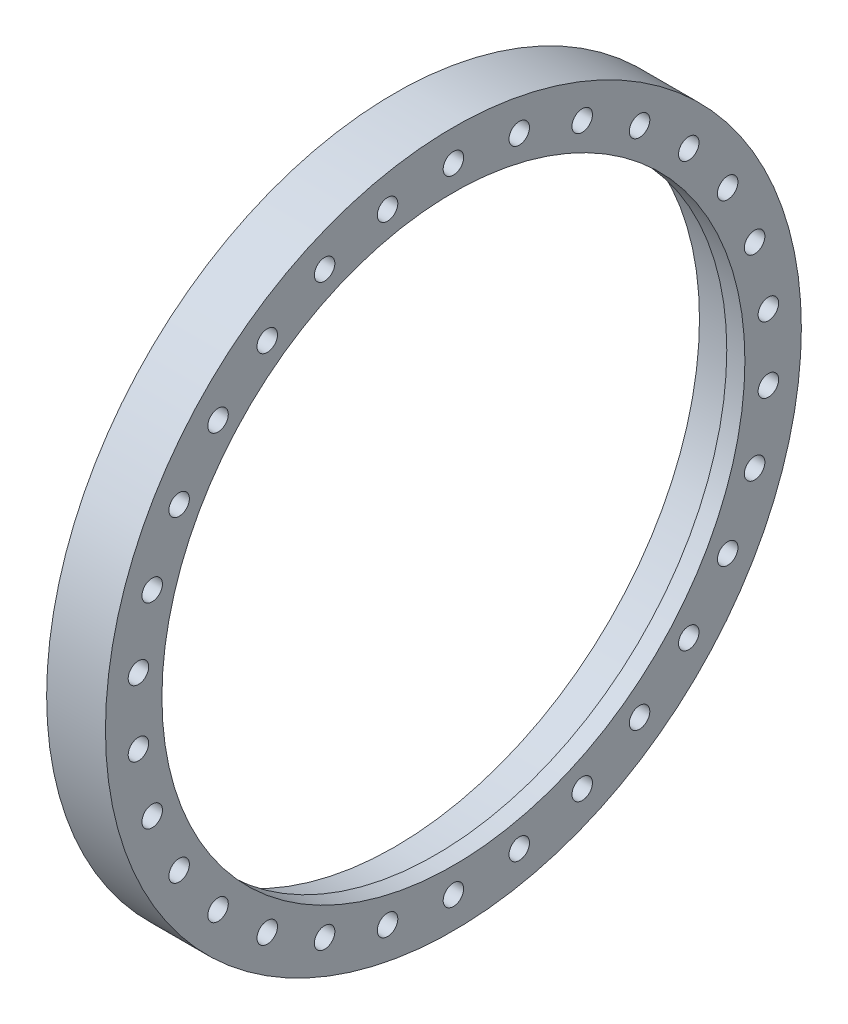
ISO-10303-21;
HEADER;
FILE_DESCRIPTION(('STEP AP214'),'2;1');
FILE_NAME('part.step','',(''),(''),'','','');
FILE_SCHEMA(('AUTOMOTIVE_DESIGN { 1 0 10303 214 1 1 1 1 }'));
ENDSEC;
DATA;
#1=APPLICATION_CONTEXT('core data for automotive mechanical design processes');
#2=APPLICATION_PROTOCOL_DEFINITION('international standard','automotive_design',2000,#1);
#3=PRODUCT_CONTEXT('',#1,'mechanical');
#4=PRODUCT('Part','Part','',(#3));
#5=PRODUCT_RELATED_PRODUCT_CATEGORY('part','',(#4));
#6=PRODUCT_DEFINITION_FORMATION('','',#4);
#7=PRODUCT_DEFINITION_CONTEXT('part definition',#1,'design');
#8=PRODUCT_DEFINITION('design','',#6,#7);
#9=PRODUCT_DEFINITION_SHAPE('','',#8);
#10=(LENGTH_UNIT() NAMED_UNIT(*) SI_UNIT(.MILLI.,.METRE.));
#11=(NAMED_UNIT(*) PLANE_ANGLE_UNIT() SI_UNIT($,.RADIAN.));
#12=(NAMED_UNIT(*) SI_UNIT($,.STERADIAN.) SOLID_ANGLE_UNIT());
#13=UNCERTAINTY_MEASURE_WITH_UNIT(LENGTH_MEASURE(1.E-05),#10,'distance_accuracy_value','');
#14=(GEOMETRIC_REPRESENTATION_CONTEXT(3) GLOBAL_UNCERTAINTY_ASSIGNED_CONTEXT((#13)) GLOBAL_UNIT_ASSIGNED_CONTEXT((#10,
#11,#12)) REPRESENTATION_CONTEXT('',''));
#15=CARTESIAN_POINT('',(0.,0.,0.));
#16=DIRECTION('',(0.,0.,1.));
#17=DIRECTION('',(1.,0.,0.));
#18=AXIS2_PLACEMENT_3D('',#15,#16,#17);
#19=CARTESIAN_POINT('',(19.6849999999996,144.2085,0.));
#20=DIRECTION('',(-1.,0.,0.));
#21=DIRECTION('',(0.,0.,1.));
#22=AXIS2_PLACEMENT_3D('',#19,#20,#21);
#23=PLANE('',#22);
#24=CARTESIAN_POINT('',(19.6849999999996,0.,0.));
#25=DIRECTION('',(1.,0.,0.));
#26=DIRECTION('',(0.,0.,-1.));
#27=AXIS2_PLACEMENT_3D('',#24,#25,#26);
#28=CIRCLE('',#27,140.97);
#29=CARTESIAN_POINT('',(19.6849999999996,0.,-140.97));
#30=VERTEX_POINT('',#29);
#31=EDGE_CURVE('E19',#30,#30,#28,.T.);
#32=ORIENTED_EDGE('',*,*,#31,.T.);
#33=EDGE_LOOP('',(#32));
#34=FACE_BOUND('',#33,.T.);
#35=CARTESIAN_POINT('',(19.6849999999996,0.,0.));
#36=DIRECTION('',(1.,0.,0.));
#37=DIRECTION('',(0.,0.,-1.));
#38=AXIS2_PLACEMENT_3D('',#35,#36,#37);
#39=CIRCLE('',#38,147.447);
#40=CARTESIAN_POINT('',(19.6849999999996,0.,-147.447));
#41=VERTEX_POINT('',#40);
#42=EDGE_CURVE('E215',#41,#41,#39,.F.);
#43=ORIENTED_EDGE('',*,*,#42,.T.);
#44=EDGE_LOOP('',(#43));
#45=FACE_BOUND('',#44,.T.);
#46=ADVANCED_FACE('F15',(#34,#45),#23,.T.);
#47=CARTESIAN_POINT('',(24.0664999999997,0.,0.));
#48=DIRECTION('',(1.,0.,0.));
#49=DIRECTION('',(0.,0.,-1.));
#50=AXIS2_PLACEMENT_3D('',#47,#48,#49);
#51=CYLINDRICAL_SURFACE('',#50,140.97);
#52=CARTESIAN_POINT('',(28.4479999999997,0.,0.));
#53=DIRECTION('',(1.,0.,0.));
#54=DIRECTION('',(0.,0.,-1.));
#55=AXIS2_PLACEMENT_3D('',#52,#53,#54);
#56=CIRCLE('',#55,140.97);
#57=CARTESIAN_POINT('',(28.4479999999997,0.,-140.97));
#58=VERTEX_POINT('',#57);
#59=EDGE_CURVE('E123',#58,#58,#56,.F.);
#60=ORIENTED_EDGE('',*,*,#59,.F.);
#61=EDGE_LOOP('',(#60));
#62=FACE_BOUND('',#61,.T.);
#63=ORIENTED_EDGE('',*,*,#31,.F.);
#64=EDGE_LOOP('',(#63));
#65=FACE_BOUND('',#64,.T.);
#66=ADVANCED_FACE('F223',(#62,#65),#51,.F.);
#67=CARTESIAN_POINT('',(0.,76.5810000000001,132.642182894432));
#68=DIRECTION('',(1.,0.,0.));
#69=DIRECTION('',(0.,0.,-1.));
#70=AXIS2_PLACEMENT_3D('',#67,#68,#69);
#71=CYLINDRICAL_SURFACE('',#70,4.953);
#72=CARTESIAN_POINT('',(0.,76.5810000000001,132.642182894432));
#73=DIRECTION('',(1.,0.,0.));
#74=DIRECTION('',(0.,0.,-1.));
#75=AXIS2_PLACEMENT_3D('',#72,#73,#74);
#76=CIRCLE('',#75,4.953);
#77=CARTESIAN_POINT('',(0.,76.5810000000001,127.689182894432));
#78=VERTEX_POINT('',#77);
#79=EDGE_CURVE('E120',#78,#78,#76,.T.);
#80=ORIENTED_EDGE('',*,*,#79,.F.);
#81=EDGE_LOOP('',(#80));
#82=FACE_BOUND('',#81,.T.);
#83=CARTESIAN_POINT('',(28.4479999999997,76.5810000000001,132.642182894432));
#84=DIRECTION('',(1.,0.,0.));
#85=DIRECTION('',(0.,0.,-1.));
#86=AXIS2_PLACEMENT_3D('',#83,#84,#85);
#87=CIRCLE('',#86,4.953);
#88=CARTESIAN_POINT('',(28.4479999999997,76.5810000000001,127.689182894432));
#89=VERTEX_POINT('',#88);
#90=EDGE_CURVE('E213',#89,#89,#87,.F.);
#91=ORIENTED_EDGE('',*,*,#90,.F.);
#92=EDGE_LOOP('',(#91));
#93=FACE_BOUND('',#92,.T.);
#94=ADVANCED_FACE('F225',(#82,#93),#71,.F.);
#95=CARTESIAN_POINT('',(0.,102.485381931135,113.821547759769));
#96=DIRECTION('',(1.,0.,0.));
#97=DIRECTION('',(0.,0.,-1.));
#98=AXIS2_PLACEMENT_3D('',#95,#96,#97);
#99=CYLINDRICAL_SURFACE('',#98,4.95299999999999);
#100=CARTESIAN_POINT('',(0.,102.485381931135,113.821547759769));
#101=DIRECTION('',(1.,0.,0.));
#102=DIRECTION('',(0.,0.,-1.));
#103=AXIS2_PLACEMENT_3D('',#100,#101,#102);
#104=CIRCLE('',#103,4.95299999999999);
#105=CARTESIAN_POINT('',(0.,102.485381931135,108.868547759769));
#106=VERTEX_POINT('',#105);
#107=EDGE_CURVE('E117',#106,#106,#104,.T.);
#108=ORIENTED_EDGE('',*,*,#107,.F.);
#109=EDGE_LOOP('',(#108));
#110=FACE_BOUND('',#109,.T.);
#111=CARTESIAN_POINT('',(28.4479999999997,102.485381931135,113.821547759769));
#112=DIRECTION('',(1.,0.,0.));
#113=DIRECTION('',(0.,0.,-1.));
#114=AXIS2_PLACEMENT_3D('',#111,#112,#113);
#115=CIRCLE('',#114,4.95299999999999);
#116=CARTESIAN_POINT('',(28.4479999999997,102.485381931135,108.868547759769));
#117=VERTEX_POINT('',#116);
#118=EDGE_CURVE('E210',#117,#117,#115,.F.);
#119=ORIENTED_EDGE('',*,*,#118,.F.);
#120=EDGE_LOOP('',(#119));
#121=FACE_BOUND('',#120,.T.);
#122=ADVANCED_FACE('F233',(#110,#121),#99,.F.);
#123=CARTESIAN_POINT('',(0.,123.910660892456,90.0263648116197));
#124=DIRECTION('',(1.,0.,0.));
#125=DIRECTION('',(0.,0.,-1.));
#126=AXIS2_PLACEMENT_3D('',#123,#124,#125);
#127=CYLINDRICAL_SURFACE('',#126,4.95300000000001);
#128=CARTESIAN_POINT('',(0.,123.910660892456,90.0263648116197));
#129=DIRECTION('',(1.,0.,0.));
#130=DIRECTION('',(0.,0.,-1.));
#131=AXIS2_PLACEMENT_3D('',#128,#129,#130);
#132=CIRCLE('',#131,4.95300000000001);
#133=CARTESIAN_POINT('',(0.,123.910660892456,85.0733648116197));
#134=VERTEX_POINT('',#133);
#135=EDGE_CURVE('E114',#134,#134,#132,.T.);
#136=ORIENTED_EDGE('',*,*,#135,.F.);
#137=EDGE_LOOP('',(#136));
#138=FACE_BOUND('',#137,.T.);
#139=CARTESIAN_POINT('',(28.4479999999997,123.910660892456,90.0263648116197));
#140=DIRECTION('',(1.,0.,0.));
#141=DIRECTION('',(0.,0.,-1.));
#142=AXIS2_PLACEMENT_3D('',#139,#140,#141);
#143=CIRCLE('',#142,4.95300000000001);
#144=CARTESIAN_POINT('',(28.4479999999997,123.910660892456,85.0733648116197));
#145=VERTEX_POINT('',#144);
#146=EDGE_CURVE('E207',#145,#145,#143,.F.);
#147=ORIENTED_EDGE('',*,*,#146,.F.);
#148=EDGE_LOOP('',(#147));
#149=FACE_BOUND('',#148,.T.);
#150=ADVANCED_FACE('F332',(#138,#149),#127,.F.);
#151=CARTESIAN_POINT('',(0.,139.920449383456,62.2965977267756));
#152=DIRECTION('',(1.,0.,0.));
#153=DIRECTION('',(0.,0.,-1.));
#154=AXIS2_PLACEMENT_3D('',#151,#152,#153);
#155=CYLINDRICAL_SURFACE('',#154,4.95300000000005);
#156=CARTESIAN_POINT('',(0.,139.920449383456,62.2965977267756));
#157=DIRECTION('',(1.,0.,0.));
#158=DIRECTION('',(0.,0.,-1.));
#159=AXIS2_PLACEMENT_3D('',#156,#157,#158);
#160=CIRCLE('',#159,4.95300000000005);
#161=CARTESIAN_POINT('',(0.,139.920449383456,57.3435977267755));
#162=VERTEX_POINT('',#161);
#163=EDGE_CURVE('E111',#162,#162,#160,.T.);
#164=ORIENTED_EDGE('',*,*,#163,.F.);
#165=EDGE_LOOP('',(#164));
#166=FACE_BOUND('',#165,.T.);
#167=CARTESIAN_POINT('',(28.4479999999997,139.920449383456,62.2965977267756));
#168=DIRECTION('',(1.,0.,0.));
#169=DIRECTION('',(0.,0.,-1.));
#170=AXIS2_PLACEMENT_3D('',#167,#168,#169);
#171=CIRCLE('',#170,4.95300000000005);
#172=CARTESIAN_POINT('',(28.4479999999997,139.920449383456,57.3435977267755));
#173=VERTEX_POINT('',#172);
#174=EDGE_CURVE('E204',#173,#173,#171,.F.);
#175=ORIENTED_EDGE('',*,*,#174,.F.);
#176=EDGE_LOOP('',(#175));
#177=FACE_BOUND('',#176,.T.);
#178=ADVANCED_FACE('F339',(#166,#177),#155,.F.);
#179=CARTESIAN_POINT('',(0.,149.815042823591,31.8441703890296));
#180=DIRECTION('',(1.,0.,0.));
#181=DIRECTION('',(0.,0.,-1.));
#182=AXIS2_PLACEMENT_3D('',#179,#180,#181);
#183=CYLINDRICAL_SURFACE('',#182,4.953);
#184=CARTESIAN_POINT('',(0.,149.815042823591,31.8441703890296));
#185=DIRECTION('',(1.,0.,0.));
#186=DIRECTION('',(0.,0.,-1.));
#187=AXIS2_PLACEMENT_3D('',#184,#185,#186);
#188=CIRCLE('',#187,4.953);
#189=CARTESIAN_POINT('',(0.,149.815042823591,26.8911703890296));
#190=VERTEX_POINT('',#189);
#191=EDGE_CURVE('E108',#190,#190,#188,.T.);
#192=ORIENTED_EDGE('',*,*,#191,.F.);
#193=EDGE_LOOP('',(#192));
#194=FACE_BOUND('',#193,.T.);
#195=CARTESIAN_POINT('',(28.4479999999997,149.815042823591,31.8441703890296));
#196=DIRECTION('',(1.,0.,0.));
#197=DIRECTION('',(0.,0.,-1.));
#198=AXIS2_PLACEMENT_3D('',#195,#196,#197);
#199=CIRCLE('',#198,4.953);
#200=CARTESIAN_POINT('',(28.4479999999997,149.815042823591,26.8911703890296));
#201=VERTEX_POINT('',#200);
#202=EDGE_CURVE('E201',#201,#201,#199,.F.);
#203=ORIENTED_EDGE('',*,*,#202,.F.);
#204=EDGE_LOOP('',(#203));
#205=FACE_BOUND('',#204,.T.);
#206=ADVANCED_FACE('F345',(#194,#205),#183,.F.);
#207=CARTESIAN_POINT('',(0.,153.162,0.));
#208=DIRECTION('',(1.,0.,0.));
#209=DIRECTION('',(0.,0.,-1.));
#210=AXIS2_PLACEMENT_3D('',#207,#208,#209);
#211=CYLINDRICAL_SURFACE('',#210,4.95299999999998);
#212=CARTESIAN_POINT('',(0.,153.162,0.));
#213=DIRECTION('',(1.,0.,0.));
#214=DIRECTION('',(0.,0.,-1.));
#215=AXIS2_PLACEMENT_3D('',#212,#213,#214);
#216=CIRCLE('',#215,4.95299999999998);
#217=CARTESIAN_POINT('',(0.,153.162,-4.95300000000003));
#218=VERTEX_POINT('',#217);
#219=EDGE_CURVE('E105',#218,#218,#216,.T.);
#220=ORIENTED_EDGE('',*,*,#219,.F.);
#221=EDGE_LOOP('',(#220));
#222=FACE_BOUND('',#221,.T.);
#223=CARTESIAN_POINT('',(28.4479999999997,153.162,0.));
#224=DIRECTION('',(1.,0.,0.));
#225=DIRECTION('',(0.,0.,-1.));
#226=AXIS2_PLACEMENT_3D('',#223,#224,#225);
#227=CIRCLE('',#226,4.95299999999998);
#228=CARTESIAN_POINT('',(28.4479999999997,153.162,-4.95300000000003));
#229=VERTEX_POINT('',#228);
#230=EDGE_CURVE('E198',#229,#229,#227,.F.);
#231=ORIENTED_EDGE('',*,*,#230,.F.);
#232=EDGE_LOOP('',(#231));
#233=FACE_BOUND('',#232,.T.);
#234=ADVANCED_FACE('F349',(#222,#233),#211,.F.);
#235=CARTESIAN_POINT('',(0.,149.815042823591,-31.8441703890297));
#236=DIRECTION('',(1.,0.,0.));
#237=DIRECTION('',(0.,0.,-1.));
#238=AXIS2_PLACEMENT_3D('',#235,#236,#237);
#239=CYLINDRICAL_SURFACE('',#238,4.95299999999997);
#240=CARTESIAN_POINT('',(0.,149.815042823591,-31.8441703890297));
#241=DIRECTION('',(1.,0.,0.));
#242=DIRECTION('',(0.,0.,-1.));
#243=AXIS2_PLACEMENT_3D('',#240,#241,#242);
#244=CIRCLE('',#243,4.95299999999997);
#245=CARTESIAN_POINT('',(0.,149.815042823591,-36.7971703890297));
#246=VERTEX_POINT('',#245);
#247=EDGE_CURVE('E102',#246,#246,#244,.T.);
#248=ORIENTED_EDGE('',*,*,#247,.F.);
#249=EDGE_LOOP('',(#248));
#250=FACE_BOUND('',#249,.T.);
#251=CARTESIAN_POINT('',(28.4479999999997,149.815042823591,-31.8441703890297));
#252=DIRECTION('',(1.,0.,0.));
#253=DIRECTION('',(0.,0.,-1.));
#254=AXIS2_PLACEMENT_3D('',#251,#252,#253);
#255=CIRCLE('',#254,4.95299999999997);
#256=CARTESIAN_POINT('',(28.4479999999997,149.815042823591,-36.7971703890297));
#257=VERTEX_POINT('',#256);
#258=EDGE_CURVE('E195',#257,#257,#255,.F.);
#259=ORIENTED_EDGE('',*,*,#258,.F.);
#260=EDGE_LOOP('',(#259));
#261=FACE_BOUND('',#260,.T.);
#262=ADVANCED_FACE('F353',(#250,#261),#239,.F.);
#263=CARTESIAN_POINT('',(0.,139.920449383456,-62.2965977267757));
#264=DIRECTION('',(1.,0.,0.));
#265=DIRECTION('',(0.,0.,-1.));
#266=AXIS2_PLACEMENT_3D('',#263,#264,#265);
#267=CYLINDRICAL_SURFACE('',#266,4.95299999999999);
#268=CARTESIAN_POINT('',(0.,139.920449383456,-62.2965977267757));
#269=DIRECTION('',(1.,0.,0.));
#270=DIRECTION('',(0.,0.,-1.));
#271=AXIS2_PLACEMENT_3D('',#268,#269,#270);
#272=CIRCLE('',#271,4.95299999999999);
#273=CARTESIAN_POINT('',(0.,139.920449383456,-67.2495977267757));
#274=VERTEX_POINT('',#273);
#275=EDGE_CURVE('E99',#274,#274,#272,.T.);
#276=ORIENTED_EDGE('',*,*,#275,.F.);
#277=EDGE_LOOP('',(#276));
#278=FACE_BOUND('',#277,.T.);
#279=CARTESIAN_POINT('',(28.4479999999997,139.920449383456,-62.2965977267757));
#280=DIRECTION('',(1.,0.,0.));
#281=DIRECTION('',(0.,0.,-1.));
#282=AXIS2_PLACEMENT_3D('',#279,#280,#281);
#283=CIRCLE('',#282,4.95299999999999);
#284=CARTESIAN_POINT('',(28.4479999999997,139.920449383456,-67.2495977267757));
#285=VERTEX_POINT('',#284);
#286=EDGE_CURVE('E192',#285,#285,#283,.F.);
#287=ORIENTED_EDGE('',*,*,#286,.F.);
#288=EDGE_LOOP('',(#287));
#289=FACE_BOUND('',#288,.T.);
#290=ADVANCED_FACE('F357',(#278,#289),#267,.F.);
#291=CARTESIAN_POINT('',(0.,123.910660892456,-90.0263648116198));
#292=DIRECTION('',(1.,0.,0.));
#293=DIRECTION('',(0.,0.,-1.));
#294=AXIS2_PLACEMENT_3D('',#291,#292,#293);
#295=CYLINDRICAL_SURFACE('',#294,4.95299999999998);
#296=CARTESIAN_POINT('',(0.,123.910660892456,-90.0263648116198));
#297=DIRECTION('',(1.,0.,0.));
#298=DIRECTION('',(0.,0.,-1.));
#299=AXIS2_PLACEMENT_3D('',#296,#297,#298);
#300=CIRCLE('',#299,4.95299999999998);
#301=CARTESIAN_POINT('',(0.,123.910660892456,-94.9793648116198));
#302=VERTEX_POINT('',#301);
#303=EDGE_CURVE('E96',#302,#302,#300,.T.);
#304=ORIENTED_EDGE('',*,*,#303,.F.);
#305=EDGE_LOOP('',(#304));
#306=FACE_BOUND('',#305,.T.);
#307=CARTESIAN_POINT('',(28.4479999999997,123.910660892456,-90.0263648116198));
#308=DIRECTION('',(1.,0.,0.));
#309=DIRECTION('',(0.,0.,-1.));
#310=AXIS2_PLACEMENT_3D('',#307,#308,#309);
#311=CIRCLE('',#310,4.95299999999998);
#312=CARTESIAN_POINT('',(28.4479999999997,123.910660892456,-94.9793648116198));
#313=VERTEX_POINT('',#312);
#314=EDGE_CURVE('E189',#313,#313,#311,.F.);
#315=ORIENTED_EDGE('',*,*,#314,.F.);
#316=EDGE_LOOP('',(#315));
#317=FACE_BOUND('',#316,.T.);
#318=ADVANCED_FACE('F361',(#306,#317),#295,.F.);
#319=CARTESIAN_POINT('',(0.,102.485381931135,-113.821547759769));
#320=DIRECTION('',(1.,0.,0.));
#321=DIRECTION('',(0.,0.,-1.));
#322=AXIS2_PLACEMENT_3D('',#319,#320,#321);
#323=CYLINDRICAL_SURFACE('',#322,4.95300000000001);
#324=CARTESIAN_POINT('',(0.,102.485381931135,-113.821547759769));
#325=DIRECTION('',(1.,0.,0.));
#326=DIRECTION('',(0.,0.,-1.));
#327=AXIS2_PLACEMENT_3D('',#324,#325,#326);
#328=CIRCLE('',#327,4.95300000000001);
#329=CARTESIAN_POINT('',(0.,102.485381931135,-118.774547759769));
#330=VERTEX_POINT('',#329);
#331=EDGE_CURVE('E93',#330,#330,#328,.T.);
#332=ORIENTED_EDGE('',*,*,#331,.F.);
#333=EDGE_LOOP('',(#332));
#334=FACE_BOUND('',#333,.T.);
#335=CARTESIAN_POINT('',(28.4479999999997,102.485381931135,-113.821547759769));
#336=DIRECTION('',(1.,0.,0.));
#337=DIRECTION('',(0.,0.,-1.));
#338=AXIS2_PLACEMENT_3D('',#335,#336,#337);
#339=CIRCLE('',#338,4.95300000000001);
#340=CARTESIAN_POINT('',(28.4479999999997,102.485381931135,-118.774547759769));
#341=VERTEX_POINT('',#340);
#342=EDGE_CURVE('E186',#341,#341,#339,.F.);
#343=ORIENTED_EDGE('',*,*,#342,.F.);
#344=EDGE_LOOP('',(#343));
#345=FACE_BOUND('',#344,.T.);
#346=ADVANCED_FACE('F365',(#334,#345),#323,.F.);
#347=CARTESIAN_POINT('',(0.,76.581,-132.642182894432));
#348=DIRECTION('',(1.,0.,0.));
#349=DIRECTION('',(0.,0.,-1.));
#350=AXIS2_PLACEMENT_3D('',#347,#348,#349);
#351=CYLINDRICAL_SURFACE('',#350,4.953);
#352=CARTESIAN_POINT('',(0.,76.581,-132.642182894432));
#353=DIRECTION('',(1.,0.,0.));
#354=DIRECTION('',(0.,0.,-1.));
#355=AXIS2_PLACEMENT_3D('',#352,#353,#354);
#356=CIRCLE('',#355,4.953);
#357=CARTESIAN_POINT('',(0.,76.581,-137.595182894432));
#358=VERTEX_POINT('',#357);
#359=EDGE_CURVE('E90',#358,#358,#356,.T.);
#360=ORIENTED_EDGE('',*,*,#359,.F.);
#361=EDGE_LOOP('',(#360));
#362=FACE_BOUND('',#361,.T.);
#363=CARTESIAN_POINT('',(28.4479999999997,76.581,-132.642182894432));
#364=DIRECTION('',(1.,0.,0.));
#365=DIRECTION('',(0.,0.,-1.));
#366=AXIS2_PLACEMENT_3D('',#363,#364,#365);
#367=CIRCLE('',#366,4.953);
#368=CARTESIAN_POINT('',(28.4479999999997,76.581,-137.595182894432));
#369=VERTEX_POINT('',#368);
#370=EDGE_CURVE('E183',#369,#369,#367,.F.);
#371=ORIENTED_EDGE('',*,*,#370,.F.);
#372=EDGE_LOOP('',(#371));
#373=FACE_BOUND('',#372,.T.);
#374=ADVANCED_FACE('F369',(#362,#373),#351,.F.);
#375=CARTESIAN_POINT('',(0.,47.3296608924556,-145.665718148798));
#376=DIRECTION('',(1.,0.,0.));
#377=DIRECTION('',(0.,0.,-1.));
#378=AXIS2_PLACEMENT_3D('',#375,#376,#377);
#379=CYLINDRICAL_SURFACE('',#378,4.95300000000004);
#380=CARTESIAN_POINT('',(0.,47.3296608924556,-145.665718148798));
#381=DIRECTION('',(1.,0.,0.));
#382=DIRECTION('',(0.,0.,-1.));
#383=AXIS2_PLACEMENT_3D('',#380,#381,#382);
#384=CIRCLE('',#383,4.95300000000004);
#385=CARTESIAN_POINT('',(0.,47.3296608924556,-150.618718148798));
#386=VERTEX_POINT('',#385);
#387=EDGE_CURVE('E87',#386,#386,#384,.T.);
#388=ORIENTED_EDGE('',*,*,#387,.F.);
#389=EDGE_LOOP('',(#388));
#390=FACE_BOUND('',#389,.T.);
#391=CARTESIAN_POINT('',(28.4479999999997,47.3296608924556,-145.665718148798));
#392=DIRECTION('',(1.,0.,0.));
#393=DIRECTION('',(0.,0.,-1.));
#394=AXIS2_PLACEMENT_3D('',#391,#392,#393);
#395=CIRCLE('',#394,4.95300000000004);
#396=CARTESIAN_POINT('',(28.4479999999997,47.3296608924556,-150.618718148798));
#397=VERTEX_POINT('',#396);
#398=EDGE_CURVE('E180',#397,#397,#395,.F.);
#399=ORIENTED_EDGE('',*,*,#398,.F.);
#400=EDGE_LOOP('',(#399));
#401=FACE_BOUND('',#400,.T.);
#402=ADVANCED_FACE('F373',(#390,#401),#379,.F.);
#403=CARTESIAN_POINT('',(0.,16.0097884910003,-152.322962538396));
#404=DIRECTION('',(1.,0.,0.));
#405=DIRECTION('',(0.,0.,-1.));
#406=AXIS2_PLACEMENT_3D('',#403,#404,#405);
#407=CYLINDRICAL_SURFACE('',#406,4.95299999999999);
#408=CARTESIAN_POINT('',(0.,16.0097884910003,-152.322962538396));
#409=DIRECTION('',(1.,0.,0.));
#410=DIRECTION('',(0.,0.,-1.));
#411=AXIS2_PLACEMENT_3D('',#408,#409,#410);
#412=CIRCLE('',#411,4.95299999999999);
#413=CARTESIAN_POINT('',(0.,16.0097884910003,-157.275962538395));
#414=VERTEX_POINT('',#413);
#415=EDGE_CURVE('E84',#414,#414,#412,.T.);
#416=ORIENTED_EDGE('',*,*,#415,.F.);
#417=EDGE_LOOP('',(#416));
#418=FACE_BOUND('',#417,.T.);
#419=CARTESIAN_POINT('',(28.4479999999997,16.0097884910003,-152.322962538396));
#420=DIRECTION('',(1.,0.,0.));
#421=DIRECTION('',(0.,0.,-1.));
#422=AXIS2_PLACEMENT_3D('',#419,#420,#421);
#423=CIRCLE('',#422,4.95299999999999);
#424=CARTESIAN_POINT('',(28.4479999999997,16.0097884910003,-157.275962538395));
#425=VERTEX_POINT('',#424);
#426=EDGE_CURVE('E177',#425,#425,#423,.F.);
#427=ORIENTED_EDGE('',*,*,#426,.F.);
#428=EDGE_LOOP('',(#427));
#429=FACE_BOUND('',#428,.T.);
#430=ADVANCED_FACE('F377',(#418,#429),#407,.F.);
#431=CARTESIAN_POINT('',(0.,-16.0097884910003,-152.322962538396));
#432=DIRECTION('',(1.,0.,0.));
#433=DIRECTION('',(0.,0.,-1.));
#434=AXIS2_PLACEMENT_3D('',#431,#432,#433);
#435=CYLINDRICAL_SURFACE('',#434,4.953);
#436=CARTESIAN_POINT('',(0.,-16.0097884910003,-152.322962538396));
#437=DIRECTION('',(1.,0.,0.));
#438=DIRECTION('',(0.,0.,-1.));
#439=AXIS2_PLACEMENT_3D('',#436,#437,#438);
#440=CIRCLE('',#439,4.953);
#441=CARTESIAN_POINT('',(0.,-16.0097884910003,-157.275962538396));
#442=VERTEX_POINT('',#441);
#443=EDGE_CURVE('E81',#442,#442,#440,.T.);
#444=ORIENTED_EDGE('',*,*,#443,.F.);
#445=EDGE_LOOP('',(#444));
#446=FACE_BOUND('',#445,.T.);
#447=CARTESIAN_POINT('',(28.4479999999997,-16.0097884910003,-152.322962538396));
#448=DIRECTION('',(1.,0.,0.));
#449=DIRECTION('',(0.,0.,-1.));
#450=AXIS2_PLACEMENT_3D('',#447,#448,#449);
#451=CIRCLE('',#450,4.953);
#452=CARTESIAN_POINT('',(28.4479999999997,-16.0097884910003,-157.275962538396));
#453=VERTEX_POINT('',#452);
#454=EDGE_CURVE('E174',#453,#453,#451,.F.);
#455=ORIENTED_EDGE('',*,*,#454,.F.);
#456=EDGE_LOOP('',(#455));
#457=FACE_BOUND('',#456,.T.);
#458=ADVANCED_FACE('F381',(#446,#457),#435,.F.);
#459=CARTESIAN_POINT('',(0.,-47.3296608924557,-145.665718148798));
#460=DIRECTION('',(1.,0.,0.));
#461=DIRECTION('',(0.,0.,-1.));
#462=AXIS2_PLACEMENT_3D('',#459,#460,#461);
#463=CYLINDRICAL_SURFACE('',#462,4.95299999999998);
#464=CARTESIAN_POINT('',(0.,-47.3296608924557,-145.665718148798));
#465=DIRECTION('',(1.,0.,0.));
#466=DIRECTION('',(0.,0.,-1.));
#467=AXIS2_PLACEMENT_3D('',#464,#465,#466);
#468=CIRCLE('',#467,4.95299999999998);
#469=CARTESIAN_POINT('',(0.,-47.3296608924557,-150.618718148798));
#470=VERTEX_POINT('',#469);
#471=EDGE_CURVE('E78',#470,#470,#468,.T.);
#472=ORIENTED_EDGE('',*,*,#471,.F.);
#473=EDGE_LOOP('',(#472));
#474=FACE_BOUND('',#473,.T.);
#475=CARTESIAN_POINT('',(28.4479999999997,-47.3296608924557,-145.665718148798));
#476=DIRECTION('',(1.,0.,0.));
#477=DIRECTION('',(0.,0.,-1.));
#478=AXIS2_PLACEMENT_3D('',#475,#476,#477);
#479=CIRCLE('',#478,4.95299999999998);
#480=CARTESIAN_POINT('',(28.4479999999997,-47.3296608924557,-150.618718148798));
#481=VERTEX_POINT('',#480);
#482=EDGE_CURVE('E171',#481,#481,#479,.F.);
#483=ORIENTED_EDGE('',*,*,#482,.F.);
#484=EDGE_LOOP('',(#483));
#485=FACE_BOUND('',#484,.T.);
#486=ADVANCED_FACE('F385',(#474,#485),#463,.F.);
#487=CARTESIAN_POINT('',(0.,-76.581,-132.642182894432));
#488=DIRECTION('',(1.,0.,0.));
#489=DIRECTION('',(0.,0.,-1.));
#490=AXIS2_PLACEMENT_3D('',#487,#488,#489);
#491=CYLINDRICAL_SURFACE('',#490,4.95299999999995);
#492=CARTESIAN_POINT('',(0.,-76.581,-132.642182894432));
#493=DIRECTION('',(1.,0.,0.));
#494=DIRECTION('',(0.,0.,-1.));
#495=AXIS2_PLACEMENT_3D('',#492,#493,#494);
#496=CIRCLE('',#495,4.95299999999995);
#497=CARTESIAN_POINT('',(0.,-76.581,-137.595182894432));
#498=VERTEX_POINT('',#497);
#499=EDGE_CURVE('E75',#498,#498,#496,.T.);
#500=ORIENTED_EDGE('',*,*,#499,.F.);
#501=EDGE_LOOP('',(#500));
#502=FACE_BOUND('',#501,.T.);
#503=CARTESIAN_POINT('',(28.4479999999997,-76.581,-132.642182894432));
#504=DIRECTION('',(1.,0.,0.));
#505=DIRECTION('',(0.,0.,-1.));
#506=AXIS2_PLACEMENT_3D('',#503,#504,#505);
#507=CIRCLE('',#506,4.95299999999995);
#508=CARTESIAN_POINT('',(28.4479999999997,-76.581,-137.595182894432));
#509=VERTEX_POINT('',#508);
#510=EDGE_CURVE('E168',#509,#509,#507,.F.);
#511=ORIENTED_EDGE('',*,*,#510,.F.);
#512=EDGE_LOOP('',(#511));
#513=FACE_BOUND('',#512,.T.);
#514=ADVANCED_FACE('F389',(#502,#513),#491,.F.);
#515=CARTESIAN_POINT('',(0.,-102.485381931135,-113.821547759769));
#516=DIRECTION('',(1.,0.,0.));
#517=DIRECTION('',(0.,0.,-1.));
#518=AXIS2_PLACEMENT_3D('',#515,#516,#517);
#519=CYLINDRICAL_SURFACE('',#518,4.95299999999999);
#520=CARTESIAN_POINT('',(0.,-102.485381931135,-113.821547759769));
#521=DIRECTION('',(1.,0.,0.));
#522=DIRECTION('',(0.,0.,-1.));
#523=AXIS2_PLACEMENT_3D('',#520,#521,#522);
#524=CIRCLE('',#523,4.95299999999999);
#525=CARTESIAN_POINT('',(0.,-102.485381931135,-118.774547759769));
#526=VERTEX_POINT('',#525);
#527=EDGE_CURVE('E72',#526,#526,#524,.T.);
#528=ORIENTED_EDGE('',*,*,#527,.F.);
#529=EDGE_LOOP('',(#528));
#530=FACE_BOUND('',#529,.T.);
#531=CARTESIAN_POINT('',(28.4479999999997,-102.485381931135,-113.821547759769));
#532=DIRECTION('',(1.,0.,0.));
#533=DIRECTION('',(0.,0.,-1.));
#534=AXIS2_PLACEMENT_3D('',#531,#532,#533);
#535=CIRCLE('',#534,4.95299999999999);
#536=CARTESIAN_POINT('',(28.4479999999997,-102.485381931135,-118.774547759769));
#537=VERTEX_POINT('',#536);
#538=EDGE_CURVE('E165',#537,#537,#535,.F.);
#539=ORIENTED_EDGE('',*,*,#538,.F.);
#540=EDGE_LOOP('',(#539));
#541=FACE_BOUND('',#540,.T.);
#542=ADVANCED_FACE('F393',(#530,#541),#519,.F.);
#543=CARTESIAN_POINT('',(0.,-123.910660892456,-90.0263648116198));
#544=DIRECTION('',(1.,0.,0.));
#545=DIRECTION('',(0.,0.,-1.));
#546=AXIS2_PLACEMENT_3D('',#543,#544,#545);
#547=CYLINDRICAL_SURFACE('',#546,4.95300000000001);
#548=CARTESIAN_POINT('',(0.,-123.910660892456,-90.0263648116198));
#549=DIRECTION('',(1.,0.,0.));
#550=DIRECTION('',(0.,0.,-1.));
#551=AXIS2_PLACEMENT_3D('',#548,#549,#550);
#552=CIRCLE('',#551,4.95300000000001);
#553=CARTESIAN_POINT('',(0.,-123.910660892456,-94.9793648116198));
#554=VERTEX_POINT('',#553);
#555=EDGE_CURVE('E69',#554,#554,#552,.T.);
#556=ORIENTED_EDGE('',*,*,#555,.F.);
#557=EDGE_LOOP('',(#556));
#558=FACE_BOUND('',#557,.T.);
#559=CARTESIAN_POINT('',(28.4479999999997,-123.910660892456,-90.0263648116198));
#560=DIRECTION('',(1.,0.,0.));
#561=DIRECTION('',(0.,0.,-1.));
#562=AXIS2_PLACEMENT_3D('',#559,#560,#561);
#563=CIRCLE('',#562,4.95300000000001);
#564=CARTESIAN_POINT('',(28.4479999999997,-123.910660892456,-94.9793648116198));
#565=VERTEX_POINT('',#564);
#566=EDGE_CURVE('E162',#565,#565,#563,.F.);
#567=ORIENTED_EDGE('',*,*,#566,.F.);
#568=EDGE_LOOP('',(#567));
#569=FACE_BOUND('',#568,.T.);
#570=ADVANCED_FACE('F397',(#558,#569),#547,.F.);
#571=CARTESIAN_POINT('',(0.,-139.920449383456,-62.2965977267757));
#572=DIRECTION('',(1.,0.,0.));
#573=DIRECTION('',(0.,0.,-1.));
#574=AXIS2_PLACEMENT_3D('',#571,#572,#573);
#575=CYLINDRICAL_SURFACE('',#574,4.95299999999997);
#576=CARTESIAN_POINT('',(0.,-139.920449383456,-62.2965977267757));
#577=DIRECTION('',(1.,0.,0.));
#578=DIRECTION('',(0.,0.,-1.));
#579=AXIS2_PLACEMENT_3D('',#576,#577,#578);
#580=CIRCLE('',#579,4.95299999999997);
#581=CARTESIAN_POINT('',(0.,-139.920449383456,-67.2495977267757));
#582=VERTEX_POINT('',#581);
#583=EDGE_CURVE('E66',#582,#582,#580,.T.);
#584=ORIENTED_EDGE('',*,*,#583,.F.);
#585=EDGE_LOOP('',(#584));
#586=FACE_BOUND('',#585,.T.);
#587=CARTESIAN_POINT('',(28.4479999999997,-139.920449383456,-62.2965977267757));
#588=DIRECTION('',(1.,0.,0.));
#589=DIRECTION('',(0.,0.,-1.));
#590=AXIS2_PLACEMENT_3D('',#587,#588,#589);
#591=CIRCLE('',#590,4.95299999999997);
#592=CARTESIAN_POINT('',(28.4479999999997,-139.920449383456,-67.2495977267757));
#593=VERTEX_POINT('',#592);
#594=EDGE_CURVE('E159',#593,#593,#591,.F.);
#595=ORIENTED_EDGE('',*,*,#594,.F.);
#596=EDGE_LOOP('',(#595));
#597=FACE_BOUND('',#596,.T.);
#598=ADVANCED_FACE('F401',(#586,#597),#575,.F.);
#599=CARTESIAN_POINT('',(0.,-149.815042823591,-31.8441703890297));
#600=DIRECTION('',(1.,0.,0.));
#601=DIRECTION('',(0.,0.,-1.));
#602=AXIS2_PLACEMENT_3D('',#599,#600,#601);
#603=CYLINDRICAL_SURFACE('',#602,4.953);
#604=CARTESIAN_POINT('',(0.,-149.815042823591,-31.8441703890297));
#605=DIRECTION('',(1.,0.,0.));
#606=DIRECTION('',(0.,0.,-1.));
#607=AXIS2_PLACEMENT_3D('',#604,#605,#606);
#608=CIRCLE('',#607,4.953);
#609=CARTESIAN_POINT('',(0.,-149.815042823591,-36.7971703890297));
#610=VERTEX_POINT('',#609);
#611=EDGE_CURVE('E63',#610,#610,#608,.T.);
#612=ORIENTED_EDGE('',*,*,#611,.F.);
#613=EDGE_LOOP('',(#612));
#614=FACE_BOUND('',#613,.T.);
#615=CARTESIAN_POINT('',(28.4479999999997,-149.815042823591,-31.8441703890297));
#616=DIRECTION('',(1.,0.,0.));
#617=DIRECTION('',(0.,0.,-1.));
#618=AXIS2_PLACEMENT_3D('',#615,#616,#617);
#619=CIRCLE('',#618,4.953);
#620=CARTESIAN_POINT('',(28.4479999999997,-149.815042823591,-36.7971703890297));
#621=VERTEX_POINT('',#620);
#622=EDGE_CURVE('E156',#621,#621,#619,.F.);
#623=ORIENTED_EDGE('',*,*,#622,.F.);
#624=EDGE_LOOP('',(#623));
#625=FACE_BOUND('',#624,.T.);
#626=ADVANCED_FACE('F405',(#614,#625),#603,.F.);
#627=CARTESIAN_POINT('',(0.,-153.162,0.));
#628=DIRECTION('',(1.,0.,0.));
#629=DIRECTION('',(0.,0.,-1.));
#630=AXIS2_PLACEMENT_3D('',#627,#628,#629);
#631=CYLINDRICAL_SURFACE('',#630,4.95299999999998);
#632=CARTESIAN_POINT('',(0.,-153.162,0.));
#633=DIRECTION('',(1.,0.,0.));
#634=DIRECTION('',(0.,0.,-1.));
#635=AXIS2_PLACEMENT_3D('',#632,#633,#634);
#636=CIRCLE('',#635,4.95299999999998);
#637=CARTESIAN_POINT('',(0.,-153.162,-4.95299999999993));
#638=VERTEX_POINT('',#637);
#639=EDGE_CURVE('E60',#638,#638,#636,.T.);
#640=ORIENTED_EDGE('',*,*,#639,.F.);
#641=EDGE_LOOP('',(#640));
#642=FACE_BOUND('',#641,.T.);
#643=CARTESIAN_POINT('',(28.4479999999997,-153.162,0.));
#644=DIRECTION('',(1.,0.,0.));
#645=DIRECTION('',(0.,0.,-1.));
#646=AXIS2_PLACEMENT_3D('',#643,#644,#645);
#647=CIRCLE('',#646,4.95299999999998);
#648=CARTESIAN_POINT('',(28.4479999999997,-153.162,-4.95299999999993));
#649=VERTEX_POINT('',#648);
#650=EDGE_CURVE('E153',#649,#649,#647,.F.);
#651=ORIENTED_EDGE('',*,*,#650,.F.);
#652=EDGE_LOOP('',(#651));
#653=FACE_BOUND('',#652,.T.);
#654=ADVANCED_FACE('F409',(#642,#653),#631,.F.);
#655=CARTESIAN_POINT('',(0.,-149.815042823591,31.8441703890297));
#656=DIRECTION('',(1.,0.,0.));
#657=DIRECTION('',(0.,0.,-1.));
#658=AXIS2_PLACEMENT_3D('',#655,#656,#657);
#659=CYLINDRICAL_SURFACE('',#658,4.95299999999997);
#660=CARTESIAN_POINT('',(0.,-149.815042823591,31.8441703890297));
#661=DIRECTION('',(1.,0.,0.));
#662=DIRECTION('',(0.,0.,-1.));
#663=AXIS2_PLACEMENT_3D('',#660,#661,#662);
#664=CIRCLE('',#663,4.95299999999997);
#665=CARTESIAN_POINT('',(0.,-149.815042823591,26.8911703890297));
#666=VERTEX_POINT('',#665);
#667=EDGE_CURVE('E57',#666,#666,#664,.T.);
#668=ORIENTED_EDGE('',*,*,#667,.F.);
#669=EDGE_LOOP('',(#668));
#670=FACE_BOUND('',#669,.T.);
#671=CARTESIAN_POINT('',(28.4479999999997,-149.815042823591,31.8441703890297));
#672=DIRECTION('',(1.,0.,0.));
#673=DIRECTION('',(0.,0.,-1.));
#674=AXIS2_PLACEMENT_3D('',#671,#672,#673);
#675=CIRCLE('',#674,4.95299999999997);
#676=CARTESIAN_POINT('',(28.4479999999997,-149.815042823591,26.8911703890297));
#677=VERTEX_POINT('',#676);
#678=EDGE_CURVE('E150',#677,#677,#675,.F.);
#679=ORIENTED_EDGE('',*,*,#678,.F.);
#680=EDGE_LOOP('',(#679));
#681=FACE_BOUND('',#680,.T.);
#682=ADVANCED_FACE('F413',(#670,#681),#659,.F.);
#683=CARTESIAN_POINT('',(0.,-139.920449383456,62.2965977267757));
#684=DIRECTION('',(1.,0.,0.));
#685=DIRECTION('',(0.,0.,-1.));
#686=AXIS2_PLACEMENT_3D('',#683,#684,#685);
#687=CYLINDRICAL_SURFACE('',#686,4.95299999999999);
#688=CARTESIAN_POINT('',(0.,-139.920449383456,62.2965977267757));
#689=DIRECTION('',(1.,0.,0.));
#690=DIRECTION('',(0.,0.,-1.));
#691=AXIS2_PLACEMENT_3D('',#688,#689,#690);
#692=CIRCLE('',#691,4.95299999999999);
#693=CARTESIAN_POINT('',(0.,-139.920449383456,57.3435977267757));
#694=VERTEX_POINT('',#693);
#695=EDGE_CURVE('E54',#694,#694,#692,.T.);
#696=ORIENTED_EDGE('',*,*,#695,.F.);
#697=EDGE_LOOP('',(#696));
#698=FACE_BOUND('',#697,.T.);
#699=CARTESIAN_POINT('',(28.4479999999997,-139.920449383456,62.2965977267757));
#700=DIRECTION('',(1.,0.,0.));
#701=DIRECTION('',(0.,0.,-1.));
#702=AXIS2_PLACEMENT_3D('',#699,#700,#701);
#703=CIRCLE('',#702,4.95299999999999);
#704=CARTESIAN_POINT('',(28.4479999999997,-139.920449383456,57.3435977267757));
#705=VERTEX_POINT('',#704);
#706=EDGE_CURVE('E147',#705,#705,#703,.F.);
#707=ORIENTED_EDGE('',*,*,#706,.F.);
#708=EDGE_LOOP('',(#707));
#709=FACE_BOUND('',#708,.T.);
#710=ADVANCED_FACE('F417',(#698,#709),#687,.F.);
#711=CARTESIAN_POINT('',(0.,-123.910660892456,90.0263648116198));
#712=DIRECTION('',(1.,0.,0.));
#713=DIRECTION('',(0.,0.,-1.));
#714=AXIS2_PLACEMENT_3D('',#711,#712,#713);
#715=CYLINDRICAL_SURFACE('',#714,4.95299999999999);
#716=CARTESIAN_POINT('',(0.,-123.910660892456,90.0263648116198));
#717=DIRECTION('',(1.,0.,0.));
#718=DIRECTION('',(0.,0.,-1.));
#719=AXIS2_PLACEMENT_3D('',#716,#717,#718);
#720=CIRCLE('',#719,4.95299999999999);
#721=CARTESIAN_POINT('',(0.,-123.910660892456,85.0733648116198));
#722=VERTEX_POINT('',#721);
#723=EDGE_CURVE('E51',#722,#722,#720,.T.);
#724=ORIENTED_EDGE('',*,*,#723,.F.);
#725=EDGE_LOOP('',(#724));
#726=FACE_BOUND('',#725,.T.);
#727=CARTESIAN_POINT('',(28.4479999999997,-123.910660892456,90.0263648116198));
#728=DIRECTION('',(1.,0.,0.));
#729=DIRECTION('',(0.,0.,-1.));
#730=AXIS2_PLACEMENT_3D('',#727,#728,#729);
#731=CIRCLE('',#730,4.95299999999999);
#732=CARTESIAN_POINT('',(28.4479999999997,-123.910660892456,85.0733648116198));
#733=VERTEX_POINT('',#732);
#734=EDGE_CURVE('E144',#733,#733,#731,.F.);
#735=ORIENTED_EDGE('',*,*,#734,.F.);
#736=EDGE_LOOP('',(#735));
#737=FACE_BOUND('',#736,.T.);
#738=ADVANCED_FACE('F421',(#726,#737),#715,.F.);
#739=CARTESIAN_POINT('',(0.,-102.485381931136,113.821547759769));
#740=DIRECTION('',(1.,0.,0.));
#741=DIRECTION('',(0.,0.,-1.));
#742=AXIS2_PLACEMENT_3D('',#739,#740,#741);
#743=CYLINDRICAL_SURFACE('',#742,4.95300000000001);
#744=CARTESIAN_POINT('',(0.,-102.485381931136,113.821547759769));
#745=DIRECTION('',(1.,0.,0.));
#746=DIRECTION('',(0.,0.,-1.));
#747=AXIS2_PLACEMENT_3D('',#744,#745,#746);
#748=CIRCLE('',#747,4.95300000000001);
#749=CARTESIAN_POINT('',(0.,-102.485381931136,108.868547759769));
#750=VERTEX_POINT('',#749);
#751=EDGE_CURVE('E48',#750,#750,#748,.T.);
#752=ORIENTED_EDGE('',*,*,#751,.F.);
#753=EDGE_LOOP('',(#752));
#754=FACE_BOUND('',#753,.T.);
#755=CARTESIAN_POINT('',(28.4479999999997,-102.485381931136,113.821547759769));
#756=DIRECTION('',(1.,0.,0.));
#757=DIRECTION('',(0.,0.,-1.));
#758=AXIS2_PLACEMENT_3D('',#755,#756,#757);
#759=CIRCLE('',#758,4.95300000000001);
#760=CARTESIAN_POINT('',(28.4479999999997,-102.485381931136,108.868547759769));
#761=VERTEX_POINT('',#760);
#762=EDGE_CURVE('E141',#761,#761,#759,.F.);
#763=ORIENTED_EDGE('',*,*,#762,.F.);
#764=EDGE_LOOP('',(#763));
#765=FACE_BOUND('',#764,.T.);
#766=ADVANCED_FACE('F425',(#754,#765),#743,.F.);
#767=CARTESIAN_POINT('',(0.,-76.581,132.642182894432));
#768=DIRECTION('',(1.,0.,0.));
#769=DIRECTION('',(0.,0.,-1.));
#770=AXIS2_PLACEMENT_3D('',#767,#768,#769);
#771=CYLINDRICAL_SURFACE('',#770,4.953);
#772=CARTESIAN_POINT('',(0.,-76.581,132.642182894432));
#773=DIRECTION('',(1.,0.,0.));
#774=DIRECTION('',(0.,0.,-1.));
#775=AXIS2_PLACEMENT_3D('',#772,#773,#774);
#776=CIRCLE('',#775,4.953);
#777=CARTESIAN_POINT('',(0.,-76.581,127.689182894432));
#778=VERTEX_POINT('',#777);
#779=EDGE_CURVE('E45',#778,#778,#776,.T.);
#780=ORIENTED_EDGE('',*,*,#779,.F.);
#781=EDGE_LOOP('',(#780));
#782=FACE_BOUND('',#781,.T.);
#783=CARTESIAN_POINT('',(28.4479999999997,-76.581,132.642182894432));
#784=DIRECTION('',(1.,0.,0.));
#785=DIRECTION('',(0.,0.,-1.));
#786=AXIS2_PLACEMENT_3D('',#783,#784,#785);
#787=CIRCLE('',#786,4.953);
#788=CARTESIAN_POINT('',(28.4479999999997,-76.581,127.689182894432));
#789=VERTEX_POINT('',#788);
#790=EDGE_CURVE('E138',#789,#789,#787,.F.);
#791=ORIENTED_EDGE('',*,*,#790,.F.);
#792=EDGE_LOOP('',(#791));
#793=FACE_BOUND('',#792,.T.);
#794=ADVANCED_FACE('F429',(#782,#793),#771,.F.);
#795=CARTESIAN_POINT('',(0.,-47.3296608924557,145.665718148798));
#796=DIRECTION('',(1.,0.,0.));
#797=DIRECTION('',(0.,0.,-1.));
#798=AXIS2_PLACEMENT_3D('',#795,#796,#797);
#799=CYLINDRICAL_SURFACE('',#798,4.953);
#800=CARTESIAN_POINT('',(0.,-47.3296608924557,145.665718148798));
#801=DIRECTION('',(1.,0.,0.));
#802=DIRECTION('',(0.,0.,-1.));
#803=AXIS2_PLACEMENT_3D('',#800,#801,#802);
#804=CIRCLE('',#803,4.953);
#805=CARTESIAN_POINT('',(0.,-47.3296608924557,140.712718148798));
#806=VERTEX_POINT('',#805);
#807=EDGE_CURVE('E42',#806,#806,#804,.T.);
#808=ORIENTED_EDGE('',*,*,#807,.F.);
#809=EDGE_LOOP('',(#808));
#810=FACE_BOUND('',#809,.T.);
#811=CARTESIAN_POINT('',(28.4479999999997,-47.3296608924557,145.665718148798));
#812=DIRECTION('',(1.,0.,0.));
#813=DIRECTION('',(0.,0.,-1.));
#814=AXIS2_PLACEMENT_3D('',#811,#812,#813);
#815=CIRCLE('',#814,4.953);
#816=CARTESIAN_POINT('',(28.4479999999997,-47.3296608924557,140.712718148798));
#817=VERTEX_POINT('',#816);
#818=EDGE_CURVE('E135',#817,#817,#815,.F.);
#819=ORIENTED_EDGE('',*,*,#818,.F.);
#820=EDGE_LOOP('',(#819));
#821=FACE_BOUND('',#820,.T.);
#822=ADVANCED_FACE('F433',(#810,#821),#799,.F.);
#823=CARTESIAN_POINT('',(0.,-16.0097884910003,152.322962538396));
#824=DIRECTION('',(1.,0.,0.));
#825=DIRECTION('',(0.,0.,-1.));
#826=AXIS2_PLACEMENT_3D('',#823,#824,#825);
#827=CYLINDRICAL_SURFACE('',#826,4.95300000000001);
#828=CARTESIAN_POINT('',(0.,-16.0097884910003,152.322962538396));
#829=DIRECTION('',(1.,0.,0.));
#830=DIRECTION('',(0.,0.,-1.));
#831=AXIS2_PLACEMENT_3D('',#828,#829,#830);
#832=CIRCLE('',#831,4.95300000000001);
#833=CARTESIAN_POINT('',(0.,-16.0097884910003,147.369962538396));
#834=VERTEX_POINT('',#833);
#835=EDGE_CURVE('E39',#834,#834,#832,.T.);
#836=ORIENTED_EDGE('',*,*,#835,.F.);
#837=EDGE_LOOP('',(#836));
#838=FACE_BOUND('',#837,.T.);
#839=CARTESIAN_POINT('',(28.4479999999997,-16.0097884910003,152.322962538396));
#840=DIRECTION('',(1.,0.,0.));
#841=DIRECTION('',(0.,0.,-1.));
#842=AXIS2_PLACEMENT_3D('',#839,#840,#841);
#843=CIRCLE('',#842,4.95300000000001);
#844=CARTESIAN_POINT('',(28.4479999999997,-16.0097884910003,147.369962538396));
#845=VERTEX_POINT('',#844);
#846=EDGE_CURVE('E132',#845,#845,#843,.F.);
#847=ORIENTED_EDGE('',*,*,#846,.F.);
#848=EDGE_LOOP('',(#847));
#849=FACE_BOUND('',#848,.T.);
#850=ADVANCED_FACE('F437',(#838,#849),#827,.F.);
#851=CARTESIAN_POINT('',(0.,47.3296608924558,145.665718148798));
#852=DIRECTION('',(1.,0.,0.));
#853=DIRECTION('',(0.,0.,-1.));
#854=AXIS2_PLACEMENT_3D('',#851,#852,#853);
#855=CYLINDRICAL_SURFACE('',#854,4.95300000000002);
#856=CARTESIAN_POINT('',(0.,47.3296608924558,145.665718148798));
#857=DIRECTION('',(1.,0.,0.));
#858=DIRECTION('',(0.,0.,-1.));
#859=AXIS2_PLACEMENT_3D('',#856,#857,#858);
#860=CIRCLE('',#859,4.95300000000002);
#861=CARTESIAN_POINT('',(0.,47.3296608924558,140.712718148798));
#862=VERTEX_POINT('',#861);
#863=EDGE_CURVE('E36',#862,#862,#860,.T.);
#864=ORIENTED_EDGE('',*,*,#863,.F.);
#865=EDGE_LOOP('',(#864));
#866=FACE_BOUND('',#865,.T.);
#867=CARTESIAN_POINT('',(28.4479999999997,47.3296608924558,145.665718148798));
#868=DIRECTION('',(1.,0.,0.));
#869=DIRECTION('',(0.,0.,-1.));
#870=AXIS2_PLACEMENT_3D('',#867,#868,#869);
#871=CIRCLE('',#870,4.95300000000002);
#872=CARTESIAN_POINT('',(28.4479999999997,47.3296608924558,140.712718148798));
#873=VERTEX_POINT('',#872);
#874=EDGE_CURVE('E129',#873,#873,#871,.F.);
#875=ORIENTED_EDGE('',*,*,#874,.F.);
#876=EDGE_LOOP('',(#875));
#877=FACE_BOUND('',#876,.T.);
#878=ADVANCED_FACE('F259',(#866,#877),#855,.F.);
#879=CARTESIAN_POINT('',(0.,16.0097884910003,152.322962538396));
#880=DIRECTION('',(1.,0.,0.));
#881=DIRECTION('',(0.,0.,-1.));
#882=AXIS2_PLACEMENT_3D('',#879,#880,#881);
#883=CYLINDRICAL_SURFACE('',#882,4.95300000000003);
#884=CARTESIAN_POINT('',(0.,16.0097884910003,152.322962538396));
#885=DIRECTION('',(1.,0.,0.));
#886=DIRECTION('',(0.,0.,-1.));
#887=AXIS2_PLACEMENT_3D('',#884,#885,#886);
#888=CIRCLE('',#887,4.95300000000003);
#889=CARTESIAN_POINT('',(0.,16.0097884910003,147.369962538396));
#890=VERTEX_POINT('',#889);
#891=EDGE_CURVE('E33',#890,#890,#888,.T.);
#892=ORIENTED_EDGE('',*,*,#891,.F.);
#893=EDGE_LOOP('',(#892));
#894=FACE_BOUND('',#893,.T.);
#895=CARTESIAN_POINT('',(28.4479999999997,16.0097884910003,152.322962538396));
#896=DIRECTION('',(1.,0.,0.));
#897=DIRECTION('',(0.,0.,-1.));
#898=AXIS2_PLACEMENT_3D('',#895,#896,#897);
#899=CIRCLE('',#898,4.95300000000003);
#900=CARTESIAN_POINT('',(28.4479999999997,16.0097884910003,147.369962538396));
#901=VERTEX_POINT('',#900);
#902=EDGE_CURVE('E126',#901,#901,#899,.F.);
#903=ORIENTED_EDGE('',*,*,#902,.F.);
#904=EDGE_LOOP('',(#903));
#905=FACE_BOUND('',#904,.T.);
#906=ADVANCED_FACE('F17',(#894,#905),#883,.F.);
#907=CARTESIAN_POINT('',(9.8424999999998,0.,0.));
#908=DIRECTION('',(1.,0.,0.));
#909=DIRECTION('',(0.,0.,-1.));
#910=AXIS2_PLACEMENT_3D('',#907,#908,#909);
#911=CYLINDRICAL_SURFACE('',#910,147.447);
#912=ORIENTED_EDGE('',*,*,#42,.F.);
#913=EDGE_LOOP('',(#912));
#914=FACE_BOUND('',#913,.T.);
#915=CARTESIAN_POINT('',(0.,0.,0.));
#916=DIRECTION('',(1.,0.,0.));
#917=DIRECTION('',(0.,0.,-1.));
#918=AXIS2_PLACEMENT_3D('',#915,#916,#917);
#919=CIRCLE('',#918,147.447);
#920=CARTESIAN_POINT('',(0.,0.,-147.447));
#921=VERTEX_POINT('',#920);
#922=EDGE_CURVE('E28',#921,#921,#919,.T.);
#923=ORIENTED_EDGE('',*,*,#922,.F.);
#924=EDGE_LOOP('',(#923));
#925=FACE_BOUND('',#924,.T.);
#926=ADVANCED_FACE('F252',(#914,#925),#911,.F.);
#927=CARTESIAN_POINT('',(28.4479999999997,154.622499999999,0.));
#928=DIRECTION('',(1.,0.,0.));
#929=DIRECTION('',(0.,0.,-1.));
#930=AXIS2_PLACEMENT_3D('',#927,#928,#929);
#931=PLANE('',#930);
#932=ORIENTED_EDGE('',*,*,#59,.T.);
#933=EDGE_LOOP('',(#932));
#934=FACE_BOUND('',#933,.T.);
#935=ORIENTED_EDGE('',*,*,#902,.T.);
#936=EDGE_LOOP('',(#935));
#937=FACE_BOUND('',#936,.T.);
#938=ORIENTED_EDGE('',*,*,#874,.T.);
#939=EDGE_LOOP('',(#938));
#940=FACE_BOUND('',#939,.T.);
#941=ORIENTED_EDGE('',*,*,#846,.T.);
#942=EDGE_LOOP('',(#941));
#943=FACE_BOUND('',#942,.T.);
#944=ORIENTED_EDGE('',*,*,#818,.T.);
#945=EDGE_LOOP('',(#944));
#946=FACE_BOUND('',#945,.T.);
#947=ORIENTED_EDGE('',*,*,#790,.T.);
#948=EDGE_LOOP('',(#947));
#949=FACE_BOUND('',#948,.T.);
#950=ORIENTED_EDGE('',*,*,#762,.T.);
#951=EDGE_LOOP('',(#950));
#952=FACE_BOUND('',#951,.T.);
#953=ORIENTED_EDGE('',*,*,#734,.T.);
#954=EDGE_LOOP('',(#953));
#955=FACE_BOUND('',#954,.T.);
#956=ORIENTED_EDGE('',*,*,#706,.T.);
#957=EDGE_LOOP('',(#956));
#958=FACE_BOUND('',#957,.T.);
#959=ORIENTED_EDGE('',*,*,#678,.T.);
#960=EDGE_LOOP('',(#959));
#961=FACE_BOUND('',#960,.T.);
#962=ORIENTED_EDGE('',*,*,#650,.T.);
#963=EDGE_LOOP('',(#962));
#964=FACE_BOUND('',#963,.T.);
#965=ORIENTED_EDGE('',*,*,#622,.T.);
#966=EDGE_LOOP('',(#965));
#967=FACE_BOUND('',#966,.T.);
#968=ORIENTED_EDGE('',*,*,#594,.T.);
#969=EDGE_LOOP('',(#968));
#970=FACE_BOUND('',#969,.T.);
#971=ORIENTED_EDGE('',*,*,#566,.T.);
#972=EDGE_LOOP('',(#971));
#973=FACE_BOUND('',#972,.T.);
#974=ORIENTED_EDGE('',*,*,#538,.T.);
#975=EDGE_LOOP('',(#974));
#976=FACE_BOUND('',#975,.T.);
#977=ORIENTED_EDGE('',*,*,#510,.T.);
#978=EDGE_LOOP('',(#977));
#979=FACE_BOUND('',#978,.T.);
#980=ORIENTED_EDGE('',*,*,#482,.T.);
#981=EDGE_LOOP('',(#980));
#982=FACE_BOUND('',#981,.T.);
#983=ORIENTED_EDGE('',*,*,#454,.T.);
#984=EDGE_LOOP('',(#983));
#985=FACE_BOUND('',#984,.T.);
#986=ORIENTED_EDGE('',*,*,#426,.T.);
#987=EDGE_LOOP('',(#986));
#988=FACE_BOUND('',#987,.T.);
#989=ORIENTED_EDGE('',*,*,#398,.T.);
#990=EDGE_LOOP('',(#989));
#991=FACE_BOUND('',#990,.T.);
#992=ORIENTED_EDGE('',*,*,#370,.T.);
#993=EDGE_LOOP('',(#992));
#994=FACE_BOUND('',#993,.T.);
#995=ORIENTED_EDGE('',*,*,#342,.T.);
#996=EDGE_LOOP('',(#995));
#997=FACE_BOUND('',#996,.T.);
#998=ORIENTED_EDGE('',*,*,#314,.T.);
#999=EDGE_LOOP('',(#998));
#1000=FACE_BOUND('',#999,.T.);
#1001=ORIENTED_EDGE('',*,*,#286,.T.);
#1002=EDGE_LOOP('',(#1001));
#1003=FACE_BOUND('',#1002,.T.);
#1004=ORIENTED_EDGE('',*,*,#258,.T.);
#1005=EDGE_LOOP('',(#1004));
#1006=FACE_BOUND('',#1005,.T.);
#1007=ORIENTED_EDGE('',*,*,#230,.T.);
#1008=EDGE_LOOP('',(#1007));
#1009=FACE_BOUND('',#1008,.T.);
#1010=ORIENTED_EDGE('',*,*,#202,.T.);
#1011=EDGE_LOOP('',(#1010));
#1012=FACE_BOUND('',#1011,.T.);
#1013=ORIENTED_EDGE('',*,*,#174,.T.);
#1014=EDGE_LOOP('',(#1013));
#1015=FACE_BOUND('',#1014,.T.);
#1016=ORIENTED_EDGE('',*,*,#146,.T.);
#1017=EDGE_LOOP('',(#1016));
#1018=FACE_BOUND('',#1017,.T.);
#1019=ORIENTED_EDGE('',*,*,#118,.T.);
#1020=EDGE_LOOP('',(#1019));
#1021=FACE_BOUND('',#1020,.T.);
#1022=ORIENTED_EDGE('',*,*,#90,.T.);
#1023=EDGE_LOOP('',(#1022));
#1024=FACE_BOUND('',#1023,.T.);
#1025=CARTESIAN_POINT('',(28.4479999999997,0.,0.));
#1026=DIRECTION('',(1.,0.,0.));
#1027=DIRECTION('',(0.,0.,-1.));
#1028=AXIS2_PLACEMENT_3D('',#1025,#1026,#1027);
#1029=CIRCLE('',#1028,168.274999999998);
#1030=CARTESIAN_POINT('',(28.4479999999997,0.,-168.274999999998));
#1031=VERTEX_POINT('',#1030);
#1032=EDGE_CURVE('E23',#1031,#1031,#1029,.F.);
#1033=ORIENTED_EDGE('',*,*,#1032,.F.);
#1034=EDGE_LOOP('',(#1033));
#1035=FACE_BOUND('',#1034,.T.);
#1036=ADVANCED_FACE('F246',(#934,#937,#940,#943,#946,#949,#952,#955,#958,#961,#964,#967,#970,
#973,#976,#979,#982,#985,#988,#991,#994,#997,#1000,#1003,#1006,#1009,#1012,#1015,#1018,#1021,
#1024,#1035),#931,.T.);
#1037=CARTESIAN_POINT('',(0.,157.860999999999,0.));
#1038=DIRECTION('',(-1.,0.,0.));
#1039=DIRECTION('',(0.,0.,1.));
#1040=AXIS2_PLACEMENT_3D('',#1037,#1038,#1039);
#1041=PLANE('',#1040);
#1042=ORIENTED_EDGE('',*,*,#922,.T.);
#1043=EDGE_LOOP('',(#1042));
#1044=FACE_BOUND('',#1043,.T.);
#1045=ORIENTED_EDGE('',*,*,#891,.T.);
#1046=EDGE_LOOP('',(#1045));
#1047=FACE_BOUND('',#1046,.T.);
#1048=ORIENTED_EDGE('',*,*,#863,.T.);
#1049=EDGE_LOOP('',(#1048));
#1050=FACE_BOUND('',#1049,.T.);
#1051=ORIENTED_EDGE('',*,*,#835,.T.);
#1052=EDGE_LOOP('',(#1051));
#1053=FACE_BOUND('',#1052,.T.);
#1054=ORIENTED_EDGE('',*,*,#807,.T.);
#1055=EDGE_LOOP('',(#1054));
#1056=FACE_BOUND('',#1055,.T.);
#1057=ORIENTED_EDGE('',*,*,#779,.T.);
#1058=EDGE_LOOP('',(#1057));
#1059=FACE_BOUND('',#1058,.T.);
#1060=ORIENTED_EDGE('',*,*,#751,.T.);
#1061=EDGE_LOOP('',(#1060));
#1062=FACE_BOUND('',#1061,.T.);
#1063=ORIENTED_EDGE('',*,*,#723,.T.);
#1064=EDGE_LOOP('',(#1063));
#1065=FACE_BOUND('',#1064,.T.);
#1066=ORIENTED_EDGE('',*,*,#695,.T.);
#1067=EDGE_LOOP('',(#1066));
#1068=FACE_BOUND('',#1067,.T.);
#1069=ORIENTED_EDGE('',*,*,#667,.T.);
#1070=EDGE_LOOP('',(#1069));
#1071=FACE_BOUND('',#1070,.T.);
#1072=ORIENTED_EDGE('',*,*,#639,.T.);
#1073=EDGE_LOOP('',(#1072));
#1074=FACE_BOUND('',#1073,.T.);
#1075=ORIENTED_EDGE('',*,*,#611,.T.);
#1076=EDGE_LOOP('',(#1075));
#1077=FACE_BOUND('',#1076,.T.);
#1078=ORIENTED_EDGE('',*,*,#583,.T.);
#1079=EDGE_LOOP('',(#1078));
#1080=FACE_BOUND('',#1079,.T.);
#1081=ORIENTED_EDGE('',*,*,#555,.T.);
#1082=EDGE_LOOP('',(#1081));
#1083=FACE_BOUND('',#1082,.T.);
#1084=ORIENTED_EDGE('',*,*,#527,.T.);
#1085=EDGE_LOOP('',(#1084));
#1086=FACE_BOUND('',#1085,.T.);
#1087=ORIENTED_EDGE('',*,*,#499,.T.);
#1088=EDGE_LOOP('',(#1087));
#1089=FACE_BOUND('',#1088,.T.);
#1090=ORIENTED_EDGE('',*,*,#471,.T.);
#1091=EDGE_LOOP('',(#1090));
#1092=FACE_BOUND('',#1091,.T.);
#1093=ORIENTED_EDGE('',*,*,#443,.T.);
#1094=EDGE_LOOP('',(#1093));
#1095=FACE_BOUND('',#1094,.T.);
#1096=ORIENTED_EDGE('',*,*,#415,.T.);
#1097=EDGE_LOOP('',(#1096));
#1098=FACE_BOUND('',#1097,.T.);
#1099=ORIENTED_EDGE('',*,*,#387,.T.);
#1100=EDGE_LOOP('',(#1099));
#1101=FACE_BOUND('',#1100,.T.);
#1102=ORIENTED_EDGE('',*,*,#359,.T.);
#1103=EDGE_LOOP('',(#1102));
#1104=FACE_BOUND('',#1103,.T.);
#1105=ORIENTED_EDGE('',*,*,#331,.T.);
#1106=EDGE_LOOP('',(#1105));
#1107=FACE_BOUND('',#1106,.T.);
#1108=ORIENTED_EDGE('',*,*,#303,.T.);
#1109=EDGE_LOOP('',(#1108));
#1110=FACE_BOUND('',#1109,.T.);
#1111=ORIENTED_EDGE('',*,*,#275,.T.);
#1112=EDGE_LOOP('',(#1111));
#1113=FACE_BOUND('',#1112,.T.);
#1114=ORIENTED_EDGE('',*,*,#247,.T.);
#1115=EDGE_LOOP('',(#1114));
#1116=FACE_BOUND('',#1115,.T.);
#1117=ORIENTED_EDGE('',*,*,#219,.T.);
#1118=EDGE_LOOP('',(#1117));
#1119=FACE_BOUND('',#1118,.T.);
#1120=ORIENTED_EDGE('',*,*,#191,.T.);
#1121=EDGE_LOOP('',(#1120));
#1122=FACE_BOUND('',#1121,.T.);
#1123=ORIENTED_EDGE('',*,*,#163,.T.);
#1124=EDGE_LOOP('',(#1123));
#1125=FACE_BOUND('',#1124,.T.);
#1126=ORIENTED_EDGE('',*,*,#135,.T.);
#1127=EDGE_LOOP('',(#1126));
#1128=FACE_BOUND('',#1127,.T.);
#1129=ORIENTED_EDGE('',*,*,#107,.T.);
#1130=EDGE_LOOP('',(#1129));
#1131=FACE_BOUND('',#1130,.T.);
#1132=ORIENTED_EDGE('',*,*,#79,.T.);
#1133=EDGE_LOOP('',(#1132));
#1134=FACE_BOUND('',#1133,.T.);
#1135=CARTESIAN_POINT('',(0.,0.,0.));
#1136=DIRECTION('',(1.,0.,0.));
#1137=DIRECTION('',(0.,0.,-1.));
#1138=AXIS2_PLACEMENT_3D('',#1135,#1136,#1137);
#1139=CIRCLE('',#1138,168.274999999998);
#1140=CARTESIAN_POINT('',(0.,0.,-168.274999999998));
#1141=VERTEX_POINT('',#1140);
#1142=EDGE_CURVE('E10',#1141,#1141,#1139,.T.);
#1143=ORIENTED_EDGE('',*,*,#1142,.F.);
#1144=EDGE_LOOP('',(#1143));
#1145=FACE_BOUND('',#1144,.T.);
#1146=ADVANCED_FACE('F241',(#1044,#1047,#1050,#1053,#1056,#1059,#1062,#1065,#1068,#1071,#1074,
#1077,#1080,#1083,#1086,#1089,#1092,#1095,#1098,#1101,#1104,#1107,#1110,#1113,#1116,#1119,#1122,
#1125,#1128,#1131,#1134,#1145),#1041,.T.);
#1147=CARTESIAN_POINT('',(14.2239999999999,0.,0.));
#1148=DIRECTION('',(1.,0.,0.));
#1149=DIRECTION('',(0.,0.,-1.));
#1150=AXIS2_PLACEMENT_3D('',#1147,#1148,#1149);
#1151=CYLINDRICAL_SURFACE('',#1150,168.274999999998);
#1152=ORIENTED_EDGE('',*,*,#1142,.T.);
#1153=EDGE_LOOP('',(#1152));
#1154=FACE_BOUND('',#1153,.T.);
#1155=ORIENTED_EDGE('',*,*,#1032,.T.);
#1156=EDGE_LOOP('',(#1155));
#1157=FACE_BOUND('',#1156,.T.);
#1158=ADVANCED_FACE('F239',(#1154,#1157),#1151,.T.);
#1159=CLOSED_SHELL('',(#46,#66,#94,#122,#150,#178,#206,#234,#262,#290,#318,#346,#374,#402,#430,
#458,#486,#514,#542,#570,#598,#626,#654,#682,#710,#738,#766,#794,#822,#850,#878,#906,#926,#1036,
#1146,#1158));
#1160=MANIFOLD_SOLID_BREP('B1',#1159);
#1161=ADVANCED_BREP_SHAPE_REPRESENTATION('',(#18,#1160),#14);
#1162=SHAPE_DEFINITION_REPRESENTATION(#9,#1161);
ENDSEC;
END-ISO-10303-21;
